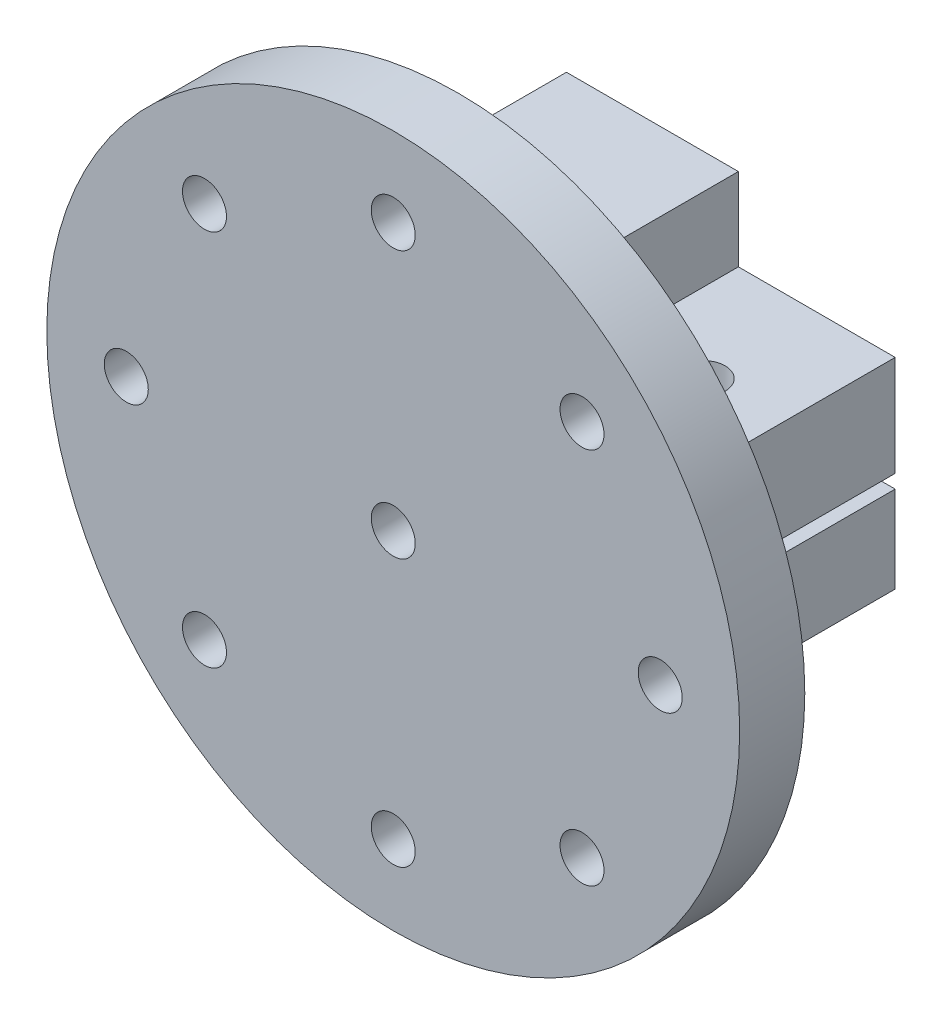
ISO-10303-21;
HEADER;
FILE_DESCRIPTION(('STEP AP214'),'2;1');
FILE_NAME('part.step','',(''),(''),'','','');
FILE_SCHEMA(('AUTOMOTIVE_DESIGN { 1 0 10303 214 1 1 1 1 }'));
ENDSEC;
DATA;
#1=APPLICATION_CONTEXT('core data for automotive mechanical design processes');
#2=APPLICATION_PROTOCOL_DEFINITION('international standard','automotive_design',2000,#1);
#3=PRODUCT_CONTEXT('',#1,'mechanical');
#4=PRODUCT('Part','Part','',(#3));
#5=PRODUCT_RELATED_PRODUCT_CATEGORY('part','',(#4));
#6=PRODUCT_DEFINITION_FORMATION('','',#4);
#7=PRODUCT_DEFINITION_CONTEXT('part definition',#1,'design');
#8=PRODUCT_DEFINITION('design','',#6,#7);
#9=PRODUCT_DEFINITION_SHAPE('','',#8);
#10=(LENGTH_UNIT() NAMED_UNIT(*) SI_UNIT(.MILLI.,.METRE.));
#11=(NAMED_UNIT(*) PLANE_ANGLE_UNIT() SI_UNIT($,.RADIAN.));
#12=(NAMED_UNIT(*) SI_UNIT($,.STERADIAN.) SOLID_ANGLE_UNIT());
#13=UNCERTAINTY_MEASURE_WITH_UNIT(LENGTH_MEASURE(1.E-05),#10,'distance_accuracy_value','');
#14=(GEOMETRIC_REPRESENTATION_CONTEXT(3) GLOBAL_UNCERTAINTY_ASSIGNED_CONTEXT((#13)) GLOBAL_UNIT_ASSIGNED_CONTEXT((#10,
#11,#12)) REPRESENTATION_CONTEXT('',''));
#15=CARTESIAN_POINT('',(0.,0.,0.));
#16=DIRECTION('',(0.,0.,1.));
#17=DIRECTION('',(1.,0.,0.));
#18=AXIS2_PLACEMENT_3D('',#15,#16,#17);
#19=CARTESIAN_POINT('',(20.8501032783887,0.,33.));
#20=DIRECTION('',(1.,0.,0.));
#21=DIRECTION('',(0.,0.,-1.));
#22=AXIS2_PLACEMENT_3D('',#19,#20,#21);
#23=PLANE('',#22);
#24=DIRECTION('',(0.,0.,-1.));
#25=VECTOR('',#24,1.);
#26=CARTESIAN_POINT('',(20.8501032783887,-0.961195415357511,33.));
#27=LINE('',#26,#25);
#28=CARTESIAN_POINT('',(20.8501032783887,-0.961195415357511,33.));
#29=VERTEX_POINT('',#28);
#30=CARTESIAN_POINT('',(20.8501032783887,-0.961195415357511,18.9436721702228));
#31=VERTEX_POINT('',#30);
#32=EDGE_CURVE('E236',#29,#31,#27,.T.);
#33=ORIENTED_EDGE('',*,*,#32,.T.);
#34=DIRECTION('',(0.,-1.,0.));
#35=VECTOR('',#34,1.);
#36=CARTESIAN_POINT('',(20.8501032783887,54.0388045846425,18.9436721702228));
#37=LINE('',#36,#35);
#38=CARTESIAN_POINT('',(20.8501032783887,-1.,18.9436721702228));
#39=VERTEX_POINT('',#38);
#40=EDGE_CURVE('E85',#31,#39,#37,.T.);
#41=ORIENTED_EDGE('',*,*,#40,.T.);
#42=DIRECTION('',(0.,0.,-1.));
#43=VECTOR('',#42,1.);
#44=CARTESIAN_POINT('',(20.8501032783887,-1.,285.));
#45=LINE('',#44,#43);
#46=CARTESIAN_POINT('',(20.8501032783887,-1.,33.0000000000001));
#47=VERTEX_POINT('',#46);
#48=EDGE_CURVE('E362',#47,#39,#45,.T.);
#49=ORIENTED_EDGE('',*,*,#48,.F.);
#50=DIRECTION('',(0.,-1.,0.));
#51=VECTOR('',#50,1.);
#52=CARTESIAN_POINT('',(20.8501032783887,0.,33.));
#53=LINE('',#52,#51);
#54=EDGE_CURVE('E426',#29,#47,#53,.T.);
#55=ORIENTED_EDGE('',*,*,#54,.F.);
#56=EDGE_LOOP('',(#33,#41,#49,#55));
#57=FACE_BOUND('',#56,.T.);
#58=ADVANCED_FACE('F69',(#57),#23,.F.);
#59=CARTESIAN_POINT('',(0.,0.,0.));
#60=DIRECTION('',(0.,0.,1.));
#61=DIRECTION('',(1.,0.,0.));
#62=AXIS2_PLACEMENT_3D('',#59,#60,#61);
#63=PLANE('',#62);
#64=DIRECTION('',(1.,0.,0.));
#65=VECTOR('',#64,1.);
#66=CARTESIAN_POINT('',(0.,1.,0.));
#67=LINE('',#66,#65);
#68=CARTESIAN_POINT('',(7.7,1.,0.));
#69=VERTEX_POINT('',#68);
#70=CARTESIAN_POINT('',(30.0469460781349,0.999999999999995,0.));
#71=VERTEX_POINT('',#70);
#72=EDGE_CURVE('E355',#69,#71,#67,.T.);
#73=ORIENTED_EDGE('',*,*,#72,.F.);
#74=DIRECTION('',(0.,-1.,0.));
#75=VECTOR('',#74,1.);
#76=CARTESIAN_POINT('',(7.7,0.,0.));
#77=LINE('',#76,#75);
#78=CARTESIAN_POINT('',(7.7,2.,0.));
#79=VERTEX_POINT('',#78);
#80=EDGE_CURVE('E461',#79,#69,#77,.T.);
#81=ORIENTED_EDGE('',*,*,#80,.F.);
#82=DIRECTION('',(1.,0.,0.));
#83=VECTOR('',#82,1.);
#84=CARTESIAN_POINT('',(0.,2.,0.));
#85=LINE('',#84,#83);
#86=CARTESIAN_POINT('',(5.65685424949238,2.,0.));
#87=VERTEX_POINT('',#86);
#88=EDGE_CURVE('E301',#87,#79,#85,.T.);
#89=ORIENTED_EDGE('',*,*,#88,.F.);
#90=CARTESIAN_POINT('',(0.,0.,0.));
#91=DIRECTION('',(0.,0.,-1.));
#92=DIRECTION('',(-1.,0.,0.));
#93=AXIS2_PLACEMENT_3D('',#90,#91,#92);
#94=CIRCLE('',#93,6.);
#95=CARTESIAN_POINT('',(5.65685424949238,-2.,0.));
#96=VERTEX_POINT('',#95);
#97=EDGE_CURVE('E279',#96,#87,#94,.T.);
#98=ORIENTED_EDGE('',*,*,#97,.F.);
#99=DIRECTION('',(-1.,0.,0.));
#100=VECTOR('',#99,1.);
#101=CARTESIAN_POINT('',(0.,-2.,0.));
#102=LINE('',#101,#100);
#103=CARTESIAN_POINT('',(7.7,-2.,0.));
#104=VERTEX_POINT('',#103);
#105=EDGE_CURVE('E283',#104,#96,#102,.T.);
#106=ORIENTED_EDGE('',*,*,#105,.F.);
#107=DIRECTION('',(0.,1.,0.));
#108=VECTOR('',#107,1.);
#109=CARTESIAN_POINT('',(7.7,0.,0.));
#110=LINE('',#109,#108);
#111=CARTESIAN_POINT('',(7.7,-1.,0.));
#112=VERTEX_POINT('',#111);
#113=EDGE_CURVE('E443',#104,#112,#110,.T.);
#114=ORIENTED_EDGE('',*,*,#113,.T.);
#115=DIRECTION('',(1.,0.,0.));
#116=VECTOR('',#115,1.);
#117=CARTESIAN_POINT('',(0.,-1.,0.));
#118=LINE('',#117,#116);
#119=CARTESIAN_POINT('',(20.8501032783887,-1.,0.));
#120=VERTEX_POINT('',#119);
#121=EDGE_CURVE('E359',#112,#120,#118,.T.);
#122=ORIENTED_EDGE('',*,*,#121,.T.);
#123=DIRECTION('',(0.,-1.,0.));
#124=VECTOR('',#123,1.);
#125=CARTESIAN_POINT('',(20.8501032783887,0.,0.));
#126=LINE('',#125,#124);
#127=CARTESIAN_POINT('',(20.8501032783887,-0.961195415357511,0.));
#128=VERTEX_POINT('',#127);
#129=EDGE_CURVE('E425',#128,#120,#126,.T.);
#130=ORIENTED_EDGE('',*,*,#129,.F.);
#131=DIRECTION('',(1.,0.,0.));
#132=VECTOR('',#131,1.);
#133=CARTESIAN_POINT('',(0.,-0.961195415357505,0.));
#134=LINE('',#133,#132);
#135=CARTESIAN_POINT('',(30.0469460781349,-0.961195415357513,0.));
#136=VERTEX_POINT('',#135);
#137=EDGE_CURVE('E235',#128,#136,#134,.T.);
#138=ORIENTED_EDGE('',*,*,#137,.T.);
#139=DIRECTION('',(0.,1.,0.));
#140=VECTOR('',#139,1.);
#141=CARTESIAN_POINT('',(30.0469460781349,0.,0.));
#142=LINE('',#141,#140);
#143=CARTESIAN_POINT('',(30.0469460781349,-13.4611954153575,0.));
#144=VERTEX_POINT('',#143);
#145=EDGE_CURVE('E428',#144,#136,#142,.T.);
#146=ORIENTED_EDGE('',*,*,#145,.F.);
#147=DIRECTION('',(1.,0.,0.));
#148=VECTOR('',#147,1.);
#149=CARTESIAN_POINT('',(7.5990817334569,-13.4611954153575,0.));
#150=LINE('',#149,#148);
#151=CARTESIAN_POINT('',(7.5990817334569,-13.4611954153575,0.));
#152=VERTEX_POINT('',#151);
#153=EDGE_CURVE('E413',#152,#144,#150,.T.);
#154=ORIENTED_EDGE('',*,*,#153,.F.);
#155=DIRECTION('',(0.,-1.,0.));
#156=VECTOR('',#155,1.);
#157=CARTESIAN_POINT('',(7.5990817334569,-6.64791006003498,0.));
#158=LINE('',#157,#156);
#159=CARTESIAN_POINT('',(7.59908173345689,-26.647910060035,0.));
#160=VERTEX_POINT('',#159);
#161=EDGE_CURVE('E254',#152,#160,#158,.T.);
#162=ORIENTED_EDGE('',*,*,#161,.T.);
#163=DIRECTION('',(1.,0.,0.));
#164=VECTOR('',#163,1.);
#165=CARTESIAN_POINT('',(-17.4009182665431,-26.647910060035,0.));
#166=LINE('',#165,#164);
#167=CARTESIAN_POINT('',(-17.4009182665431,-26.647910060035,0.));
#168=VERTEX_POINT('',#167);
#169=EDGE_CURVE('E266',#168,#160,#166,.T.);
#170=ORIENTED_EDGE('',*,*,#169,.F.);
#171=DIRECTION('',(0.,-1.,0.));
#172=VECTOR('',#171,1.);
#173=CARTESIAN_POINT('',(-17.4009182665431,-6.64791006003497,0.));
#174=LINE('',#173,#172);
#175=CARTESIAN_POINT('',(-17.4009182665431,27.414213562373,0.));
#176=VERTEX_POINT('',#175);
#177=EDGE_CURVE('E261',#176,#168,#174,.T.);
#178=ORIENTED_EDGE('',*,*,#177,.F.);
#179=DIRECTION('',(-1.,0.,0.));
#180=VECTOR('',#179,1.);
#181=CARTESIAN_POINT('',(0.,27.414213562373,0.));
#182=LINE('',#181,#180);
#183=CARTESIAN_POINT('',(7.41421356237295,27.414213562373,0.));
#184=VERTEX_POINT('',#183);
#185=EDGE_CURVE('E245',#184,#176,#182,.T.);
#186=ORIENTED_EDGE('',*,*,#185,.F.);
#187=DIRECTION('',(0.,1.,0.));
#188=VECTOR('',#187,1.);
#189=CARTESIAN_POINT('',(7.41421356237295,0.,0.));
#190=LINE('',#189,#188);
#191=CARTESIAN_POINT('',(7.41421356237295,15.5,0.));
#192=VERTEX_POINT('',#191);
#193=EDGE_CURVE('E248',#192,#184,#190,.T.);
#194=ORIENTED_EDGE('',*,*,#193,.F.);
#195=DIRECTION('',(-1.,0.,0.));
#196=VECTOR('',#195,1.);
#197=CARTESIAN_POINT('',(7.41421356237295,15.5,0.));
#198=LINE('',#197,#196);
#199=CARTESIAN_POINT('',(30.0469460781349,15.5,0.));
#200=VERTEX_POINT('',#199);
#201=EDGE_CURVE('E397',#200,#192,#198,.T.);
#202=ORIENTED_EDGE('',*,*,#201,.F.);
#203=DIRECTION('',(0.,-1.,0.));
#204=VECTOR('',#203,1.);
#205=CARTESIAN_POINT('',(30.0469460781349,0.,0.));
#206=LINE('',#205,#204);
#207=EDGE_CURVE('E408',#200,#71,#206,.T.);
#208=ORIENTED_EDGE('',*,*,#207,.T.);
#209=EDGE_LOOP('',(#73,#81,#89,#98,#106,#114,#122,#130,#138,#146,#154,#162,#170,#178,#186,#194,
#202,#208));
#210=FACE_BOUND('',#209,.T.);
#211=ADVANCED_FACE('F71',(#210),#63,.F.);
#212=CARTESIAN_POINT('',(0.,-1.,285.));
#213=DIRECTION('',(0.,1.,0.));
#214=DIRECTION('',(0.,0.,1.));
#215=AXIS2_PLACEMENT_3D('',#212,#213,#214);
#216=PLANE('',#215);
#217=CARTESIAN_POINT('',(18.8230139057959,-1.,16.5));
#218=DIRECTION('',(0.,1.,0.));
#219=DIRECTION('',(0.,0.,1.));
#220=AXIS2_PLACEMENT_3D('',#217,#218,#219);
#221=CIRCLE('',#220,3.175);
#222=CARTESIAN_POINT('',(20.8501032783887,-1.,14.0563278297772));
#223=VERTEX_POINT('',#222);
#224=EDGE_CURVE('E449',#223,#39,#221,.T.);
#225=ORIENTED_EDGE('',*,*,#224,.F.);
#226=EDGE_CURVE('E229',#223,#120,#45,.T.);
#227=ORIENTED_EDGE('',*,*,#226,.T.);
#228=ORIENTED_EDGE('',*,*,#121,.F.);
#229=DIRECTION('',(0.,0.,-1.));
#230=VECTOR('',#229,1.);
#231=CARTESIAN_POINT('',(7.7,-1.,33.));
#232=LINE('',#231,#230);
#233=CARTESIAN_POINT('',(7.7,-1.,33.));
#234=VERTEX_POINT('',#233);
#235=EDGE_CURVE('E448',#234,#112,#232,.T.);
#236=ORIENTED_EDGE('',*,*,#235,.F.);
#237=DIRECTION('',(-1.,0.,0.));
#238=VECTOR('',#237,1.);
#239=CARTESIAN_POINT('',(0.,-1.,33.));
#240=LINE('',#239,#238);
#241=EDGE_CURVE('E365',#47,#234,#240,.T.);
#242=ORIENTED_EDGE('',*,*,#241,.F.);
#243=ORIENTED_EDGE('',*,*,#48,.T.);
#244=EDGE_LOOP('',(#225,#227,#228,#236,#242,#243));
#245=FACE_BOUND('',#244,.T.);
#246=ADVANCED_FACE('F446',(#245),#216,.T.);
#247=CARTESIAN_POINT('',(0.,0.,33.));
#248=DIRECTION('',(0.,0.,1.));
#249=DIRECTION('',(1.,0.,0.));
#250=AXIS2_PLACEMENT_3D('',#247,#248,#249);
#251=PLANE('',#250);
#252=DIRECTION('',(1.,0.,0.));
#253=VECTOR('',#252,1.);
#254=CARTESIAN_POINT('',(7.5990817334569,-13.4611954153575,33.));
#255=LINE('',#254,#253);
#256=CARTESIAN_POINT('',(7.5990817334569,-13.4611954153575,33.));
#257=VERTEX_POINT('',#256);
#258=CARTESIAN_POINT('',(30.0469460781349,-13.4611954153575,33.));
#259=VERTEX_POINT('',#258);
#260=EDGE_CURVE('E410',#257,#259,#255,.T.);
#261=ORIENTED_EDGE('',*,*,#260,.T.);
#262=DIRECTION('',(0.,1.,0.));
#263=VECTOR('',#262,1.);
#264=CARTESIAN_POINT('',(30.0469460781349,0.,33.));
#265=LINE('',#264,#263);
#266=CARTESIAN_POINT('',(30.0469460781349,-0.961195415357513,33.));
#267=VERTEX_POINT('',#266);
#268=EDGE_CURVE('E237',#259,#267,#265,.T.);
#269=ORIENTED_EDGE('',*,*,#268,.T.);
#270=DIRECTION('',(1.,0.,0.));
#271=VECTOR('',#270,1.);
#272=CARTESIAN_POINT('',(0.,-0.961195415357505,33.));
#273=LINE('',#272,#271);
#274=EDGE_CURVE('E240',#29,#267,#273,.T.);
#275=ORIENTED_EDGE('',*,*,#274,.F.);
#276=ORIENTED_EDGE('',*,*,#54,.T.);
#277=ORIENTED_EDGE('',*,*,#241,.T.);
#278=DIRECTION('',(0.,1.,0.));
#279=VECTOR('',#278,1.);
#280=CARTESIAN_POINT('',(7.7,0.,33.));
#281=LINE('',#280,#279);
#282=CARTESIAN_POINT('',(7.7,-2.,33.));
#283=VERTEX_POINT('',#282);
#284=EDGE_CURVE('E467',#283,#234,#281,.T.);
#285=ORIENTED_EDGE('',*,*,#284,.F.);
#286=DIRECTION('',(-1.,0.,0.));
#287=VECTOR('',#286,1.);
#288=CARTESIAN_POINT('',(0.,-2.,33.));
#289=LINE('',#288,#287);
#290=CARTESIAN_POINT('',(5.65685424949238,-2.,33.));
#291=VERTEX_POINT('',#290);
#292=EDGE_CURVE('E286',#283,#291,#289,.T.);
#293=ORIENTED_EDGE('',*,*,#292,.T.);
#294=CARTESIAN_POINT('',(0.,0.,33.));
#295=DIRECTION('',(0.,0.,1.));
#296=DIRECTION('',(1.,0.,0.));
#297=AXIS2_PLACEMENT_3D('',#294,#295,#296);
#298=CIRCLE('',#297,6.);
#299=CARTESIAN_POINT('',(5.65685424949238,2.,33.));
#300=VERTEX_POINT('',#299);
#301=EDGE_CURVE('E371',#291,#300,#298,.T.);
#302=ORIENTED_EDGE('',*,*,#301,.T.);
#303=DIRECTION('',(1.,0.,0.));
#304=VECTOR('',#303,1.);
#305=CARTESIAN_POINT('',(0.,2.00000000000001,33.));
#306=LINE('',#305,#304);
#307=CARTESIAN_POINT('',(7.7,2.,33.));
#308=VERTEX_POINT('',#307);
#309=EDGE_CURVE('E289',#300,#308,#306,.T.);
#310=ORIENTED_EDGE('',*,*,#309,.T.);
#311=DIRECTION('',(0.,-1.,0.));
#312=VECTOR('',#311,1.);
#313=CARTESIAN_POINT('',(7.7,0.,33.));
#314=LINE('',#313,#312);
#315=CARTESIAN_POINT('',(7.7,1.,33.));
#316=VERTEX_POINT('',#315);
#317=EDGE_CURVE('E457',#308,#316,#314,.T.);
#318=ORIENTED_EDGE('',*,*,#317,.T.);
#319=DIRECTION('',(-1.,0.,0.));
#320=VECTOR('',#319,1.);
#321=CARTESIAN_POINT('',(0.,1.,33.));
#322=LINE('',#321,#320);
#323=CARTESIAN_POINT('',(30.0469460781349,0.999999999999995,33.));
#324=VERTEX_POINT('',#323);
#325=EDGE_CURVE('E368',#324,#316,#322,.T.);
#326=ORIENTED_EDGE('',*,*,#325,.F.);
#327=DIRECTION('',(0.,-1.,0.));
#328=VECTOR('',#327,1.);
#329=CARTESIAN_POINT('',(30.0469460781349,0.,33.));
#330=LINE('',#329,#328);
#331=CARTESIAN_POINT('',(30.0469460781349,15.5,33.));
#332=VERTEX_POINT('',#331);
#333=EDGE_CURVE('E93',#332,#324,#330,.T.);
#334=ORIENTED_EDGE('',*,*,#333,.F.);
#335=DIRECTION('',(-1.,0.,0.));
#336=VECTOR('',#335,1.);
#337=CARTESIAN_POINT('',(7.41421356237295,15.5,33.));
#338=LINE('',#337,#336);
#339=CARTESIAN_POINT('',(7.41421356237295,15.5,33.));
#340=VERTEX_POINT('',#339);
#341=EDGE_CURVE('E394',#332,#340,#338,.T.);
#342=ORIENTED_EDGE('',*,*,#341,.T.);
#343=DIRECTION('',(0.,-1.,0.));
#344=VECTOR('',#343,1.);
#345=CARTESIAN_POINT('',(7.41421356237295,0.,33.));
#346=LINE('',#345,#344);
#347=CARTESIAN_POINT('',(7.41421356237295,27.414213562373,33.));
#348=VERTEX_POINT('',#347);
#349=EDGE_CURVE('E12',#348,#340,#346,.T.);
#350=ORIENTED_EDGE('',*,*,#349,.F.);
#351=DIRECTION('',(1.,0.,0.));
#352=VECTOR('',#351,1.);
#353=CARTESIAN_POINT('',(0.,27.414213562373,33.));
#354=LINE('',#353,#352);
#355=CARTESIAN_POINT('',(-17.4009182665431,27.414213562373,33.));
#356=VERTEX_POINT('',#355);
#357=EDGE_CURVE('E78',#356,#348,#354,.T.);
#358=ORIENTED_EDGE('',*,*,#357,.F.);
#359=DIRECTION('',(0.,-1.,0.));
#360=VECTOR('',#359,1.);
#361=CARTESIAN_POINT('',(-17.4009182665431,-6.64791006003497,33.));
#362=LINE('',#361,#360);
#363=CARTESIAN_POINT('',(-17.4009182665431,-26.647910060035,33.));
#364=VERTEX_POINT('',#363);
#365=EDGE_CURVE('E260',#356,#364,#362,.T.);
#366=ORIENTED_EDGE('',*,*,#365,.T.);
#367=DIRECTION('',(1.,0.,0.));
#368=VECTOR('',#367,1.);
#369=CARTESIAN_POINT('',(-17.4009182665431,-26.647910060035,33.));
#370=LINE('',#369,#368);
#371=CARTESIAN_POINT('',(7.59908173345689,-26.647910060035,33.));
#372=VERTEX_POINT('',#371);
#373=EDGE_CURVE('E257',#364,#372,#370,.T.);
#374=ORIENTED_EDGE('',*,*,#373,.T.);
#375=DIRECTION('',(0.,1.,0.));
#376=VECTOR('',#375,1.);
#377=CARTESIAN_POINT('',(7.5990817334569,0.,33.));
#378=LINE('',#377,#376);
#379=EDGE_CURVE('E374',#372,#257,#378,.T.);
#380=ORIENTED_EDGE('',*,*,#379,.T.);
#381=EDGE_LOOP('',(#261,#269,#275,#276,#277,#285,#293,#302,#310,#318,#326,#334,#342,#350,#358,
#366,#374,#380));
#382=FACE_BOUND('',#381,.T.);
#383=CARTESIAN_POINT('',(0.,0.,33.));
#384=DIRECTION('',(0.,0.,1.));
#385=DIRECTION('',(1.,0.,0.));
#386=AXIS2_PLACEMENT_3D('',#383,#384,#385);
#387=CIRCLE('',#386,50.);
#388=CARTESIAN_POINT('',(50.,0.,33.));
#389=VERTEX_POINT('',#388);
#390=EDGE_CURVE('E351',#389,#389,#387,.T.);
#391=ORIENTED_EDGE('',*,*,#390,.F.);
#392=EDGE_LOOP('',(#391));
#393=FACE_BOUND('',#392,.T.);
#394=CARTESIAN_POINT('',(27.2450640302655,27.2450640302662,33.));
#395=DIRECTION('',(0.,0.,1.));
#396=DIRECTION('',(1.,0.,0.));
#397=AXIS2_PLACEMENT_3D('',#394,#395,#396);
#398=CIRCLE('',#397,3.17500000000076);
#399=CARTESIAN_POINT('',(30.4200640302663,27.2450640302662,33.));
#400=VERTEX_POINT('',#399);
#401=EDGE_CURVE('E316',#400,#400,#398,.T.);
#402=ORIENTED_EDGE('',*,*,#401,.T.);
#403=EDGE_LOOP('',(#402));
#404=FACE_BOUND('',#403,.T.);
#405=CARTESIAN_POINT('',(-1.61078463866241E-12,38.5303390593249,33.));
#406=DIRECTION('',(0.,0.,1.));
#407=DIRECTION('',(1.,0.,0.));
#408=AXIS2_PLACEMENT_3D('',#405,#406,#407);
#409=CIRCLE('',#408,3.1750000000009);
#410=CARTESIAN_POINT('',(3.17499999999929,38.5303390593249,33.));
#411=VERTEX_POINT('',#410);
#412=EDGE_CURVE('E303',#411,#411,#409,.T.);
#413=ORIENTED_EDGE('',*,*,#412,.T.);
#414=EDGE_LOOP('',(#413));
#415=FACE_BOUND('',#414,.T.);
#416=CARTESIAN_POINT('',(38.5303390593264,0.,33.));
#417=DIRECTION('',(0.,0.,1.));
#418=DIRECTION('',(1.,0.,0.));
#419=AXIS2_PLACEMENT_3D('',#416,#417,#418);
#420=CIRCLE('',#419,3.17500000000001);
#421=CARTESIAN_POINT('',(41.7053390593264,0.,33.));
#422=VERTEX_POINT('',#421);
#423=EDGE_CURVE('E308',#422,#422,#420,.T.);
#424=ORIENTED_EDGE('',*,*,#423,.T.);
#425=EDGE_LOOP('',(#424));
#426=FACE_BOUND('',#425,.T.);
#427=CARTESIAN_POINT('',(27.2450640302678,-27.2450640302671,33.));
#428=DIRECTION('',(0.,0.,1.));
#429=DIRECTION('',(1.,0.,0.));
#430=AXIS2_PLACEMENT_3D('',#427,#428,#429);
#431=CIRCLE('',#430,3.17499999999871);
#432=CARTESIAN_POINT('',(30.4200640302665,-27.2450640302671,33.));
#433=VERTEX_POINT('',#432);
#434=EDGE_CURVE('E304',#433,#433,#431,.T.);
#435=ORIENTED_EDGE('',*,*,#434,.T.);
#436=EDGE_LOOP('',(#435));
#437=FACE_BOUND('',#436,.T.);
#438=CARTESIAN_POINT('',(1.60606603302251E-12,-38.5303390593281,33.));
#439=DIRECTION('',(0.,0.,1.));
#440=DIRECTION('',(1.,0.,0.));
#441=AXIS2_PLACEMENT_3D('',#438,#439,#440);
#442=CIRCLE('',#441,3.17499999999792);
#443=CARTESIAN_POINT('',(3.17499999999953,-38.5303390593281,33.));
#444=VERTEX_POINT('',#443);
#445=EDGE_CURVE('E307',#444,#444,#442,.T.);
#446=ORIENTED_EDGE('',*,*,#445,.T.);
#447=EDGE_LOOP('',(#446));
#448=FACE_BOUND('',#447,.T.);
#449=CARTESIAN_POINT('',(-27.2450640302655,-27.2450640302694,33.));
#450=DIRECTION('',(0.,0.,1.));
#451=DIRECTION('',(1.,0.,0.));
#452=AXIS2_PLACEMENT_3D('',#449,#450,#451);
#453=CIRCLE('',#452,3.17499999999801);
#454=CARTESIAN_POINT('',(-24.0700640302675,-27.2450640302694,33.));
#455=VERTEX_POINT('',#454);
#456=EDGE_CURVE('E320',#455,#455,#453,.T.);
#457=ORIENTED_EDGE('',*,*,#456,.T.);
#458=EDGE_LOOP('',(#457));
#459=FACE_BOUND('',#458,.T.);
#460=CARTESIAN_POINT('',(-38.5303390593265,-3.21174324068629E-12,33.));
#461=DIRECTION('',(0.,0.,1.));
#462=DIRECTION('',(1.,0.,0.));
#463=AXIS2_PLACEMENT_3D('',#460,#461,#462);
#464=CIRCLE('',#463,3.17499999999894);
#465=CARTESIAN_POINT('',(-35.3553390593275,-3.21174324068629E-12,33.));
#466=VERTEX_POINT('',#465);
#467=EDGE_CURVE('E317',#466,#466,#464,.T.);
#468=ORIENTED_EDGE('',*,*,#467,.T.);
#469=EDGE_LOOP('',(#468));
#470=FACE_BOUND('',#469,.T.);
#471=CARTESIAN_POINT('',(-27.2450640302678,27.2450640302639,33.));
#472=DIRECTION('',(0.,0.,1.));
#473=DIRECTION('',(1.,0.,0.));
#474=AXIS2_PLACEMENT_3D('',#471,#472,#473);
#475=CIRCLE('',#474,3.17500000000014);
#476=CARTESIAN_POINT('',(-24.0700640302677,27.2450640302639,33.));
#477=VERTEX_POINT('',#476);
#478=EDGE_CURVE('E313',#477,#477,#475,.T.);
#479=ORIENTED_EDGE('',*,*,#478,.T.);
#480=EDGE_LOOP('',(#479));
#481=FACE_BOUND('',#480,.T.);
#482=ADVANCED_FACE('F392',(#382,#393,#404,#415,#426,#437,#448,#459,#470,#481),#251,.F.);
#483=CARTESIAN_POINT('',(7.41421356237295,0.,34.));
#484=DIRECTION('',(-1.,0.,0.));
#485=DIRECTION('',(0.,0.,1.));
#486=AXIS2_PLACEMENT_3D('',#483,#484,#485);
#487=PLANE('',#486);
#488=ORIENTED_EDGE('',*,*,#349,.T.);
#489=DIRECTION('',(0.,0.,-1.));
#490=VECTOR('',#489,1.);
#491=CARTESIAN_POINT('',(7.41421356237295,15.5,33.));
#492=LINE('',#491,#490);
#493=EDGE_CURVE('E399',#340,#192,#492,.T.);
#494=ORIENTED_EDGE('',*,*,#493,.T.);
#495=ORIENTED_EDGE('',*,*,#193,.T.);
#496=DIRECTION('',(0.,0.,-1.));
#497=VECTOR('',#496,1.);
#498=CARTESIAN_POINT('',(7.41421356237295,27.414213562373,34.));
#499=LINE('',#498,#497);
#500=EDGE_CURVE('E251',#348,#184,#499,.T.);
#501=ORIENTED_EDGE('',*,*,#500,.F.);
#502=EDGE_LOOP('',(#488,#494,#495,#501));
#503=FACE_BOUND('',#502,.T.);
#504=ADVANCED_FACE('F387',(#503),#487,.F.);
#505=CARTESIAN_POINT('',(0.,0.,34.));
#506=DIRECTION('',(0.,0.,-1.));
#507=DIRECTION('',(-1.,0.,0.));
#508=AXIS2_PLACEMENT_3D('',#505,#506,#507);
#509=CYLINDRICAL_SURFACE('',#508,6.);
#510=DIRECTION('',(0.,0.,-1.));
#511=VECTOR('',#510,1.);
#512=CARTESIAN_POINT('',(5.65685424949238,-2.,46.));
#513=LINE('',#512,#511);
#514=CARTESIAN_POINT('',(5.65685424949238,-2.,31.));
#515=VERTEX_POINT('',#514);
#516=EDGE_CURVE('E297',#515,#291,#513,.F.);
#517=ORIENTED_EDGE('',*,*,#516,.F.);
#518=CARTESIAN_POINT('',(0.,0.,31.));
#519=DIRECTION('',(0.,0.,-1.));
#520=DIRECTION('',(-1.,0.,0.));
#521=AXIS2_PLACEMENT_3D('',#518,#519,#520);
#522=CIRCLE('',#521,6.);
#523=CARTESIAN_POINT('',(5.65685424949238,2.,31.));
#524=VERTEX_POINT('',#523);
#525=EDGE_CURVE('E280',#524,#515,#522,.T.);
#526=ORIENTED_EDGE('',*,*,#525,.F.);
#527=DIRECTION('',(0.,0.,-1.));
#528=VECTOR('',#527,1.);
#529=CARTESIAN_POINT('',(5.65685424949238,2.,33.));
#530=LINE('',#529,#528);
#531=EDGE_CURVE('E294',#300,#524,#530,.T.);
#532=ORIENTED_EDGE('',*,*,#531,.F.);
#533=ORIENTED_EDGE('',*,*,#301,.F.);
#534=EDGE_LOOP('',(#517,#526,#532,#533));
#535=FACE_BOUND('',#534,.T.);
#536=ADVANCED_FACE('F524',(#535),#509,.T.);
#537=CARTESIAN_POINT('',(0.,2.,33.));
#538=DIRECTION('',(0.,1.,0.));
#539=DIRECTION('',(-1.,0.,0.));
#540=AXIS2_PLACEMENT_3D('',#537,#538,#539);
#541=PLANE('',#540);
#542=ORIENTED_EDGE('',*,*,#531,.T.);
#543=EDGE_CURVE('E291',#524,#87,#530,.T.);
#544=ORIENTED_EDGE('',*,*,#543,.T.);
#545=ORIENTED_EDGE('',*,*,#88,.T.);
#546=DIRECTION('',(0.,0.,-1.));
#547=VECTOR('',#546,1.);
#548=CARTESIAN_POINT('',(7.7,2.,33.));
#549=LINE('',#548,#547);
#550=EDGE_CURVE('E415',#308,#79,#549,.T.);
#551=ORIENTED_EDGE('',*,*,#550,.F.);
#552=ORIENTED_EDGE('',*,*,#309,.F.);
#553=EDGE_LOOP('',(#542,#544,#545,#551,#552));
#554=FACE_BOUND('',#553,.T.);
#555=ADVANCED_FACE('F527',(#554),#541,.F.);
#556=CARTESIAN_POINT('',(0.,-2.,33.));
#557=DIRECTION('',(0.,-1.,0.));
#558=DIRECTION('',(1.,0.,0.));
#559=AXIS2_PLACEMENT_3D('',#556,#557,#558);
#560=PLANE('',#559);
#561=ORIENTED_EDGE('',*,*,#105,.T.);
#562=EDGE_CURVE('E298',#96,#515,#513,.F.);
#563=ORIENTED_EDGE('',*,*,#562,.T.);
#564=ORIENTED_EDGE('',*,*,#516,.T.);
#565=ORIENTED_EDGE('',*,*,#292,.F.);
#566=DIRECTION('',(0.,0.,-1.));
#567=VECTOR('',#566,1.);
#568=CARTESIAN_POINT('',(7.7,-2.,33.));
#569=LINE('',#568,#567);
#570=EDGE_CURVE('E405',#283,#104,#569,.T.);
#571=ORIENTED_EDGE('',*,*,#570,.T.);
#572=EDGE_LOOP('',(#561,#563,#564,#565,#571));
#573=FACE_BOUND('',#572,.T.);
#574=ADVANCED_FACE('F473',(#573),#560,.F.);
#575=CARTESIAN_POINT('',(0.,1.,285.));
#576=DIRECTION('',(0.,1.,0.));
#577=DIRECTION('',(0.,0.,1.));
#578=AXIS2_PLACEMENT_3D('',#575,#576,#577);
#579=PLANE('',#578);
#580=CARTESIAN_POINT('',(18.8230139057959,1.,16.5));
#581=DIRECTION('',(0.,1.,0.));
#582=DIRECTION('',(0.,0.,1.));
#583=AXIS2_PLACEMENT_3D('',#580,#581,#582);
#584=CIRCLE('',#583,3.175);
#585=CARTESIAN_POINT('',(18.8230139057959,1.,19.675));
#586=VERTEX_POINT('',#585);
#587=EDGE_CURVE('E451',#586,#586,#584,.T.);
#588=ORIENTED_EDGE('',*,*,#587,.T.);
#589=EDGE_LOOP('',(#588));
#590=FACE_BOUND('',#589,.T.);
#591=ORIENTED_EDGE('',*,*,#325,.T.);
#592=DIRECTION('',(0.,0.,-1.));
#593=VECTOR('',#592,1.);
#594=CARTESIAN_POINT('',(7.7,1.,33.));
#595=LINE('',#594,#593);
#596=EDGE_CURVE('E460',#316,#69,#595,.T.);
#597=ORIENTED_EDGE('',*,*,#596,.T.);
#598=ORIENTED_EDGE('',*,*,#72,.T.);
#599=DIRECTION('',(0.,0.,-1.));
#600=VECTOR('',#599,1.);
#601=CARTESIAN_POINT('',(30.0469460781349,0.999999999999995,33.));
#602=LINE('',#601,#600);
#603=EDGE_CURVE('E421',#324,#71,#602,.T.);
#604=ORIENTED_EDGE('',*,*,#603,.F.);
#605=EDGE_LOOP('',(#591,#597,#598,#604));
#606=FACE_BOUND('',#605,.T.);
#607=ADVANCED_FACE('F531',(#590,#606),#579,.F.);
#608=CARTESIAN_POINT('',(0.,0.,42.398));
#609=DIRECTION('',(0.,0.,-1.));
#610=DIRECTION('',(-1.,0.,0.));
#611=AXIS2_PLACEMENT_3D('',#608,#609,#610);
#612=CYLINDRICAL_SURFACE('',#611,50.);
#613=CARTESIAN_POINT('',(0.,0.,42.398));
#614=DIRECTION('',(0.,0.,1.));
#615=DIRECTION('',(1.,0.,0.));
#616=AXIS2_PLACEMENT_3D('',#613,#614,#615);
#617=CIRCLE('',#616,50.);
#618=CARTESIAN_POINT('',(50.,0.,42.398));
#619=VERTEX_POINT('',#618);
#620=EDGE_CURVE('E352',#619,#619,#617,.T.);
#621=ORIENTED_EDGE('',*,*,#620,.F.);
#622=EDGE_LOOP('',(#621));
#623=FACE_BOUND('',#622,.T.);
#624=ORIENTED_EDGE('',*,*,#390,.T.);
#625=EDGE_LOOP('',(#624));
#626=FACE_BOUND('',#625,.T.);
#627=ADVANCED_FACE('F569',(#623,#626),#612,.T.);
#628=CARTESIAN_POINT('',(0.,0.,42.398));
#629=DIRECTION('',(0.,0.,1.));
#630=DIRECTION('',(1.,0.,0.));
#631=AXIS2_PLACEMENT_3D('',#628,#629,#630);
#632=PLANE('',#631);
#633=CARTESIAN_POINT('',(0.,0.,42.398));
#634=DIRECTION('',(0.,0.,1.));
#635=DIRECTION('',(1.,0.,0.));
#636=AXIS2_PLACEMENT_3D('',#633,#634,#635);
#637=CIRCLE('',#636,3.175);
#638=CARTESIAN_POINT('',(3.175,0.,42.398));
#639=VERTEX_POINT('',#638);
#640=EDGE_CURVE('E273',#639,#639,#637,.T.);
#641=ORIENTED_EDGE('',*,*,#640,.F.);
#642=EDGE_LOOP('',(#641));
#643=FACE_BOUND('',#642,.T.);
#644=CARTESIAN_POINT('',(-27.2450640302678,27.2450640302639,42.398));
#645=DIRECTION('',(0.,0.,1.));
#646=DIRECTION('',(1.,0.,0.));
#647=AXIS2_PLACEMENT_3D('',#644,#645,#646);
#648=CIRCLE('',#647,3.17500000000014);
#649=CARTESIAN_POINT('',(-24.0700640302677,27.2450640302639,42.398));
#650=VERTEX_POINT('',#649);
#651=EDGE_CURVE('E348',#650,#650,#648,.F.);
#652=ORIENTED_EDGE('',*,*,#651,.T.);
#653=EDGE_LOOP('',(#652));
#654=FACE_BOUND('',#653,.T.);
#655=CARTESIAN_POINT('',(-38.5303390593265,-3.21174324068629E-12,42.398));
#656=DIRECTION('',(0.,0.,1.));
#657=DIRECTION('',(1.,0.,0.));
#658=AXIS2_PLACEMENT_3D('',#655,#656,#657);
#659=CIRCLE('',#658,3.17499999999894);
#660=CARTESIAN_POINT('',(-35.3553390593275,-3.21174324068629E-12,42.398));
#661=VERTEX_POINT('',#660);
#662=EDGE_CURVE('E345',#661,#661,#659,.F.);
#663=ORIENTED_EDGE('',*,*,#662,.T.);
#664=EDGE_LOOP('',(#663));
#665=FACE_BOUND('',#664,.T.);
#666=CARTESIAN_POINT('',(-27.2450640302655,-27.2450640302694,42.398));
#667=DIRECTION('',(0.,0.,1.));
#668=DIRECTION('',(1.,0.,0.));
#669=AXIS2_PLACEMENT_3D('',#666,#667,#668);
#670=CIRCLE('',#669,3.17499999999801);
#671=CARTESIAN_POINT('',(-24.0700640302675,-27.2450640302694,42.398));
#672=VERTEX_POINT('',#671);
#673=EDGE_CURVE('E342',#672,#672,#670,.F.);
#674=ORIENTED_EDGE('',*,*,#673,.T.);
#675=EDGE_LOOP('',(#674));
#676=FACE_BOUND('',#675,.T.);
#677=CARTESIAN_POINT('',(1.60606603302251E-12,-38.5303390593281,42.398));
#678=DIRECTION('',(0.,0.,1.));
#679=DIRECTION('',(1.,0.,0.));
#680=AXIS2_PLACEMENT_3D('',#677,#678,#679);
#681=CIRCLE('',#680,3.17499999999792);
#682=CARTESIAN_POINT('',(3.17499999999953,-38.5303390593281,42.398));
#683=VERTEX_POINT('',#682);
#684=EDGE_CURVE('E339',#683,#683,#681,.F.);
#685=ORIENTED_EDGE('',*,*,#684,.T.);
#686=EDGE_LOOP('',(#685));
#687=FACE_BOUND('',#686,.T.);
#688=CARTESIAN_POINT('',(27.2450640302678,-27.2450640302671,42.398));
#689=DIRECTION('',(0.,0.,1.));
#690=DIRECTION('',(1.,0.,0.));
#691=AXIS2_PLACEMENT_3D('',#688,#689,#690);
#692=CIRCLE('',#691,3.17499999999871);
#693=CARTESIAN_POINT('',(30.4200640302665,-27.2450640302671,42.398));
#694=VERTEX_POINT('',#693);
#695=EDGE_CURVE('E336',#694,#694,#692,.F.);
#696=ORIENTED_EDGE('',*,*,#695,.T.);
#697=EDGE_LOOP('',(#696));
#698=FACE_BOUND('',#697,.T.);
#699=CARTESIAN_POINT('',(38.5303390593264,0.,42.398));
#700=DIRECTION('',(0.,0.,1.));
#701=DIRECTION('',(1.,0.,0.));
#702=AXIS2_PLACEMENT_3D('',#699,#700,#701);
#703=CIRCLE('',#702,3.17500000000001);
#704=CARTESIAN_POINT('',(41.7053390593264,0.,42.398));
#705=VERTEX_POINT('',#704);
#706=EDGE_CURVE('E333',#705,#705,#703,.F.);
#707=ORIENTED_EDGE('',*,*,#706,.T.);
#708=EDGE_LOOP('',(#707));
#709=FACE_BOUND('',#708,.T.);
#710=CARTESIAN_POINT('',(-1.61078463866241E-12,38.5303390593249,42.398));
#711=DIRECTION('',(0.,0.,1.));
#712=DIRECTION('',(1.,0.,0.));
#713=AXIS2_PLACEMENT_3D('',#710,#711,#712);
#714=CIRCLE('',#713,3.1750000000009);
#715=CARTESIAN_POINT('',(3.17499999999929,38.5303390593249,42.398));
#716=VERTEX_POINT('',#715);
#717=EDGE_CURVE('E330',#716,#716,#714,.F.);
#718=ORIENTED_EDGE('',*,*,#717,.T.);
#719=EDGE_LOOP('',(#718));
#720=FACE_BOUND('',#719,.T.);
#721=CARTESIAN_POINT('',(27.2450640302655,27.2450640302662,42.398));
#722=DIRECTION('',(0.,0.,1.));
#723=DIRECTION('',(1.,0.,0.));
#724=AXIS2_PLACEMENT_3D('',#721,#722,#723);
#725=CIRCLE('',#724,3.17500000000076);
#726=CARTESIAN_POINT('',(30.4200640302663,27.2450640302662,42.398));
#727=VERTEX_POINT('',#726);
#728=EDGE_CURVE('E327',#727,#727,#725,.F.);
#729=ORIENTED_EDGE('',*,*,#728,.T.);
#730=EDGE_LOOP('',(#729));
#731=FACE_BOUND('',#730,.T.);
#732=ORIENTED_EDGE('',*,*,#620,.T.);
#733=EDGE_LOOP('',(#732));
#734=FACE_BOUND('',#733,.T.);
#735=ADVANCED_FACE('F565',(#643,#654,#665,#676,#687,#698,#709,#720,#731,#734),#632,.T.);
#736=CARTESIAN_POINT('',(27.2450640302655,27.2450640302662,96.));
#737=DIRECTION('',(0.,0.,-1.));
#738=DIRECTION('',(-1.,0.,0.));
#739=AXIS2_PLACEMENT_3D('',#736,#737,#738);
#740=CYLINDRICAL_SURFACE('',#739,3.17500000000076);
#741=ORIENTED_EDGE('',*,*,#728,.F.);
#742=EDGE_LOOP('',(#741));
#743=FACE_BOUND('',#742,.T.);
#744=ORIENTED_EDGE('',*,*,#401,.F.);
#745=EDGE_LOOP('',(#744));
#746=FACE_BOUND('',#745,.T.);
#747=ADVANCED_FACE('F547',(#743,#746),#740,.F.);
#748=CARTESIAN_POINT('',(-1.61078463866241E-12,38.5303390593249,96.));
#749=DIRECTION('',(0.,0.,-1.));
#750=DIRECTION('',(-1.,0.,0.));
#751=AXIS2_PLACEMENT_3D('',#748,#749,#750);
#752=CYLINDRICAL_SURFACE('',#751,3.1750000000009);
#753=ORIENTED_EDGE('',*,*,#717,.F.);
#754=EDGE_LOOP('',(#753));
#755=FACE_BOUND('',#754,.T.);
#756=ORIENTED_EDGE('',*,*,#412,.F.);
#757=EDGE_LOOP('',(#756));
#758=FACE_BOUND('',#757,.T.);
#759=ADVANCED_FACE('F543',(#755,#758),#752,.F.);
#760=CARTESIAN_POINT('',(38.5303390593264,0.,96.));
#761=DIRECTION('',(0.,0.,-1.));
#762=DIRECTION('',(-1.,0.,0.));
#763=AXIS2_PLACEMENT_3D('',#760,#761,#762);
#764=CYLINDRICAL_SURFACE('',#763,3.17500000000001);
#765=ORIENTED_EDGE('',*,*,#706,.F.);
#766=EDGE_LOOP('',(#765));
#767=FACE_BOUND('',#766,.T.);
#768=ORIENTED_EDGE('',*,*,#423,.F.);
#769=EDGE_LOOP('',(#768));
#770=FACE_BOUND('',#769,.T.);
#771=ADVANCED_FACE('F539',(#767,#770),#764,.F.);
#772=CARTESIAN_POINT('',(27.2450640302678,-27.2450640302671,96.));
#773=DIRECTION('',(0.,0.,-1.));
#774=DIRECTION('',(-1.,0.,0.));
#775=AXIS2_PLACEMENT_3D('',#772,#773,#774);
#776=CYLINDRICAL_SURFACE('',#775,3.17499999999871);
#777=ORIENTED_EDGE('',*,*,#695,.F.);
#778=EDGE_LOOP('',(#777));
#779=FACE_BOUND('',#778,.T.);
#780=ORIENTED_EDGE('',*,*,#434,.F.);
#781=EDGE_LOOP('',(#780));
#782=FACE_BOUND('',#781,.T.);
#783=ADVANCED_FACE('F535',(#779,#782),#776,.F.);
#784=CARTESIAN_POINT('',(1.60606603302251E-12,-38.5303390593281,96.));
#785=DIRECTION('',(0.,0.,-1.));
#786=DIRECTION('',(-1.,0.,0.));
#787=AXIS2_PLACEMENT_3D('',#784,#785,#786);
#788=CYLINDRICAL_SURFACE('',#787,3.17499999999792);
#789=ORIENTED_EDGE('',*,*,#684,.F.);
#790=EDGE_LOOP('',(#789));
#791=FACE_BOUND('',#790,.T.);
#792=ORIENTED_EDGE('',*,*,#445,.F.);
#793=EDGE_LOOP('',(#792));
#794=FACE_BOUND('',#793,.T.);
#795=ADVANCED_FACE('F538',(#791,#794),#788,.F.);
#796=CARTESIAN_POINT('',(-27.2450640302655,-27.2450640302694,96.));
#797=DIRECTION('',(0.,0.,-1.));
#798=DIRECTION('',(-1.,0.,0.));
#799=AXIS2_PLACEMENT_3D('',#796,#797,#798);
#800=CYLINDRICAL_SURFACE('',#799,3.17499999999801);
#801=ORIENTED_EDGE('',*,*,#673,.F.);
#802=EDGE_LOOP('',(#801));
#803=FACE_BOUND('',#802,.T.);
#804=ORIENTED_EDGE('',*,*,#456,.F.);
#805=EDGE_LOOP('',(#804));
#806=FACE_BOUND('',#805,.T.);
#807=ADVANCED_FACE('F555',(#803,#806),#800,.F.);
#808=CARTESIAN_POINT('',(-38.5303390593265,-3.21174324068629E-12,96.));
#809=DIRECTION('',(0.,0.,-1.));
#810=DIRECTION('',(-1.,0.,0.));
#811=AXIS2_PLACEMENT_3D('',#808,#809,#810);
#812=CYLINDRICAL_SURFACE('',#811,3.17499999999894);
#813=ORIENTED_EDGE('',*,*,#662,.F.);
#814=EDGE_LOOP('',(#813));
#815=FACE_BOUND('',#814,.T.);
#816=ORIENTED_EDGE('',*,*,#467,.F.);
#817=EDGE_LOOP('',(#816));
#818=FACE_BOUND('',#817,.T.);
#819=ADVANCED_FACE('F551',(#815,#818),#812,.F.);
#820=CARTESIAN_POINT('',(-27.2450640302678,27.2450640302639,96.));
#821=DIRECTION('',(0.,0.,-1.));
#822=DIRECTION('',(-1.,0.,0.));
#823=AXIS2_PLACEMENT_3D('',#820,#821,#822);
#824=CYLINDRICAL_SURFACE('',#823,3.17500000000014);
#825=ORIENTED_EDGE('',*,*,#651,.F.);
#826=EDGE_LOOP('',(#825));
#827=FACE_BOUND('',#826,.T.);
#828=ORIENTED_EDGE('',*,*,#478,.F.);
#829=EDGE_LOOP('',(#828));
#830=FACE_BOUND('',#829,.T.);
#831=ADVANCED_FACE('F519',(#827,#830),#824,.F.);
#832=CARTESIAN_POINT('',(0.,0.,31.));
#833=DIRECTION('',(0.,0.,-1.));
#834=DIRECTION('',(-1.,0.,0.));
#835=AXIS2_PLACEMENT_3D('',#832,#833,#834);
#836=CYLINDRICAL_SURFACE('',#835,6.);
#837=EDGE_CURVE('E284',#515,#524,#522,.T.);
#838=ORIENTED_EDGE('',*,*,#837,.F.);
#839=ORIENTED_EDGE('',*,*,#562,.F.);
#840=ORIENTED_EDGE('',*,*,#97,.T.);
#841=ORIENTED_EDGE('',*,*,#543,.F.);
#842=EDGE_LOOP('',(#838,#839,#840,#841));
#843=FACE_BOUND('',#842,.T.);
#844=ADVANCED_FACE('F515',(#843),#836,.F.);
#845=CARTESIAN_POINT('',(0.,0.,31.));
#846=DIRECTION('',(0.,0.,-1.));
#847=DIRECTION('',(-1.,0.,0.));
#848=AXIS2_PLACEMENT_3D('',#845,#846,#847);
#849=PLANE('',#848);
#850=CARTESIAN_POINT('',(0.,0.,31.));
#851=DIRECTION('',(0.,0.,-1.));
#852=DIRECTION('',(-1.,0.,0.));
#853=AXIS2_PLACEMENT_3D('',#850,#851,#852);
#854=CIRCLE('',#853,3.175);
#855=CARTESIAN_POINT('',(-3.175,0.,31.));
#856=VERTEX_POINT('',#855);
#857=EDGE_CURVE('E276',#856,#856,#854,.T.);
#858=ORIENTED_EDGE('',*,*,#857,.F.);
#859=EDGE_LOOP('',(#858));
#860=FACE_BOUND('',#859,.T.);
#861=ORIENTED_EDGE('',*,*,#525,.T.);
#862=ORIENTED_EDGE('',*,*,#837,.T.);
#863=EDGE_LOOP('',(#861,#862));
#864=FACE_BOUND('',#863,.T.);
#865=ADVANCED_FACE('F512',(#860,#864),#849,.T.);
#866=CARTESIAN_POINT('',(0.,0.,34.));
#867=DIRECTION('',(0.,0.,-1.));
#868=DIRECTION('',(-1.,0.,0.));
#869=AXIS2_PLACEMENT_3D('',#866,#867,#868);
#870=CYLINDRICAL_SURFACE('',#869,3.175);
#871=ORIENTED_EDGE('',*,*,#857,.T.);
#872=EDGE_LOOP('',(#871));
#873=FACE_BOUND('',#872,.T.);
#874=ORIENTED_EDGE('',*,*,#640,.T.);
#875=EDGE_LOOP('',(#874));
#876=FACE_BOUND('',#875,.T.);
#877=ADVANCED_FACE('F510',(#873,#876),#870,.F.);
#878=CARTESIAN_POINT('',(7.5990817334569,-6.64791006003498,33.));
#879=DIRECTION('',(1.,0.,0.));
#880=DIRECTION('',(0.,1.,0.));
#881=AXIS2_PLACEMENT_3D('',#878,#879,#880);
#882=PLANE('',#881);
#883=ORIENTED_EDGE('',*,*,#161,.F.);
#884=DIRECTION('',(0.,0.,-1.));
#885=VECTOR('',#884,1.);
#886=CARTESIAN_POINT('',(7.5990817334569,-13.4611954153575,33.));
#887=LINE('',#886,#885);
#888=EDGE_CURVE('E412',#257,#152,#887,.T.);
#889=ORIENTED_EDGE('',*,*,#888,.F.);
#890=ORIENTED_EDGE('',*,*,#379,.F.);
#891=DIRECTION('',(0.,0.,-1.));
#892=VECTOR('',#891,1.);
#893=CARTESIAN_POINT('',(7.59908173345689,-26.647910060035,33.));
#894=LINE('',#893,#892);
#895=EDGE_CURVE('E264',#372,#160,#894,.T.);
#896=ORIENTED_EDGE('',*,*,#895,.T.);
#897=EDGE_LOOP('',(#883,#889,#890,#896));
#898=FACE_BOUND('',#897,.T.);
#899=ADVANCED_FACE('F505',(#898),#882,.T.);
#900=CARTESIAN_POINT('',(-17.4009182665431,-6.64791006003497,33.));
#901=DIRECTION('',(1.,0.,0.));
#902=DIRECTION('',(0.,0.,-1.));
#903=AXIS2_PLACEMENT_3D('',#900,#901,#902);
#904=PLANE('',#903);
#905=ORIENTED_EDGE('',*,*,#177,.T.);
#906=DIRECTION('',(0.,0.,-1.));
#907=VECTOR('',#906,1.);
#908=CARTESIAN_POINT('',(-17.4009182665431,-26.647910060035,33.));
#909=LINE('',#908,#907);
#910=EDGE_CURVE('E270',#364,#168,#909,.T.);
#911=ORIENTED_EDGE('',*,*,#910,.F.);
#912=ORIENTED_EDGE('',*,*,#365,.F.);
#913=DIRECTION('',(0.,0.,-1.));
#914=VECTOR('',#913,1.);
#915=CARTESIAN_POINT('',(-17.4009182665431,27.414213562373,34.));
#916=LINE('',#915,#914);
#917=EDGE_CURVE('E250',#356,#176,#916,.T.);
#918=ORIENTED_EDGE('',*,*,#917,.T.);
#919=EDGE_LOOP('',(#905,#911,#912,#918));
#920=FACE_BOUND('',#919,.T.);
#921=ADVANCED_FACE('F500',(#920),#904,.F.);
#922=CARTESIAN_POINT('',(-17.4009182665431,-26.647910060035,33.));
#923=DIRECTION('',(0.,1.,0.));
#924=DIRECTION('',(-1.,0.,0.));
#925=AXIS2_PLACEMENT_3D('',#922,#923,#924);
#926=PLANE('',#925);
#927=ORIENTED_EDGE('',*,*,#169,.T.);
#928=ORIENTED_EDGE('',*,*,#895,.F.);
#929=ORIENTED_EDGE('',*,*,#373,.F.);
#930=ORIENTED_EDGE('',*,*,#910,.T.);
#931=EDGE_LOOP('',(#927,#928,#929,#930));
#932=FACE_BOUND('',#931,.T.);
#933=ADVANCED_FACE('F495',(#932),#926,.F.);
#934=CARTESIAN_POINT('',(0.,27.414213562373,34.));
#935=DIRECTION('',(0.,-1.,0.));
#936=DIRECTION('',(0.,0.,-1.));
#937=AXIS2_PLACEMENT_3D('',#934,#935,#936);
#938=PLANE('',#937);
#939=ORIENTED_EDGE('',*,*,#917,.F.);
#940=ORIENTED_EDGE('',*,*,#357,.T.);
#941=ORIENTED_EDGE('',*,*,#500,.T.);
#942=ORIENTED_EDGE('',*,*,#185,.T.);
#943=EDGE_LOOP('',(#939,#940,#941,#942));
#944=FACE_BOUND('',#943,.T.);
#945=ADVANCED_FACE('F382',(#944),#938,.F.);
#946=ORIENTED_EDGE('',*,*,#226,.F.);
#947=DIRECTION('',(0.,-1.,0.));
#948=VECTOR('',#947,1.);
#949=CARTESIAN_POINT('',(20.8501032783887,54.0388045846425,14.0563278297772));
#950=LINE('',#949,#948);
#951=CARTESIAN_POINT('',(20.8501032783887,-0.961195415357511,14.0563278297772));
#952=VERTEX_POINT('',#951);
#953=EDGE_CURVE('E215',#223,#952,#950,.F.);
#954=ORIENTED_EDGE('',*,*,#953,.T.);
#955=EDGE_CURVE('E227',#952,#128,#27,.T.);
#956=ORIENTED_EDGE('',*,*,#955,.T.);
#957=ORIENTED_EDGE('',*,*,#129,.T.);
#958=EDGE_LOOP('',(#946,#954,#956,#957));
#959=FACE_BOUND('',#958,.T.);
#960=ADVANCED_FACE('F225',(#959),#23,.F.);
#961=CARTESIAN_POINT('',(30.0469460781349,0.,33.));
#962=DIRECTION('',(-1.,0.,0.));
#963=DIRECTION('',(0.,0.,1.));
#964=AXIS2_PLACEMENT_3D('',#961,#962,#963);
#965=PLANE('',#964);
#966=ORIENTED_EDGE('',*,*,#268,.F.);
#967=DIRECTION('',(0.,0.,-1.));
#968=VECTOR('',#967,1.);
#969=CARTESIAN_POINT('',(30.0469460781349,-13.4611954153575,33.));
#970=LINE('',#969,#968);
#971=EDGE_CURVE('E402',#259,#144,#970,.T.);
#972=ORIENTED_EDGE('',*,*,#971,.T.);
#973=ORIENTED_EDGE('',*,*,#145,.T.);
#974=DIRECTION('',(0.,0.,-1.));
#975=VECTOR('',#974,1.);
#976=CARTESIAN_POINT('',(30.0469460781349,-0.961195415357513,33.));
#977=LINE('',#976,#975);
#978=EDGE_CURVE('E239',#267,#136,#977,.T.);
#979=ORIENTED_EDGE('',*,*,#978,.F.);
#980=EDGE_LOOP('',(#966,#972,#973,#979));
#981=FACE_BOUND('',#980,.T.);
#982=ADVANCED_FACE('F436',(#981),#965,.F.);
#983=CARTESIAN_POINT('',(0.,-0.961195415357505,33.));
#984=DIRECTION('',(0.,1.,0.));
#985=DIRECTION('',(-1.,0.,0.));
#986=AXIS2_PLACEMENT_3D('',#983,#984,#985);
#987=PLANE('',#986);
#988=CARTESIAN_POINT('',(18.8230139057959,-0.96119541535751,16.5));
#989=DIRECTION('',(0.,1.,0.));
#990=DIRECTION('',(-1.,0.,0.));
#991=AXIS2_PLACEMENT_3D('',#988,#989,#990);
#992=CIRCLE('',#991,3.175);
#993=EDGE_CURVE('E211',#31,#952,#992,.T.);
#994=ORIENTED_EDGE('',*,*,#993,.F.);
#995=ORIENTED_EDGE('',*,*,#32,.F.);
#996=ORIENTED_EDGE('',*,*,#274,.T.);
#997=ORIENTED_EDGE('',*,*,#978,.T.);
#998=ORIENTED_EDGE('',*,*,#137,.F.);
#999=ORIENTED_EDGE('',*,*,#955,.F.);
#1000=EDGE_LOOP('',(#994,#995,#996,#997,#998,#999));
#1001=FACE_BOUND('',#1000,.T.);
#1002=ADVANCED_FACE('F232',(#1001),#987,.T.);
#1003=CARTESIAN_POINT('',(30.0469460781349,0.,33.));
#1004=DIRECTION('',(1.,0.,0.));
#1005=DIRECTION('',(0.,0.,-1.));
#1006=AXIS2_PLACEMENT_3D('',#1003,#1004,#1005);
#1007=PLANE('',#1006);
#1008=DIRECTION('',(0.,0.,-1.));
#1009=VECTOR('',#1008,1.);
#1010=CARTESIAN_POINT('',(30.0469460781349,15.5,33.));
#1011=LINE('',#1010,#1009);
#1012=EDGE_CURVE('E396',#332,#200,#1011,.T.);
#1013=ORIENTED_EDGE('',*,*,#1012,.F.);
#1014=ORIENTED_EDGE('',*,*,#333,.T.);
#1015=ORIENTED_EDGE('',*,*,#603,.T.);
#1016=ORIENTED_EDGE('',*,*,#207,.F.);
#1017=EDGE_LOOP('',(#1013,#1014,#1015,#1016));
#1018=FACE_BOUND('',#1017,.T.);
#1019=ADVANCED_FACE('F592',(#1018),#1007,.T.);
#1020=CARTESIAN_POINT('',(7.5990817334569,-13.4611954153575,33.));
#1021=DIRECTION('',(0.,1.,0.));
#1022=DIRECTION('',(-1.,0.,0.));
#1023=AXIS2_PLACEMENT_3D('',#1020,#1021,#1022);
#1024=PLANE('',#1023);
#1025=CARTESIAN_POINT('',(18.8230139057959,-13.4611954153575,16.5));
#1026=DIRECTION('',(0.,1.,0.));
#1027=DIRECTION('',(-1.,0.,0.));
#1028=AXIS2_PLACEMENT_3D('',#1025,#1026,#1027);
#1029=CIRCLE('',#1028,3.175);
#1030=CARTESIAN_POINT('',(15.6480139057959,-13.4611954153575,16.5));
#1031=VERTEX_POINT('',#1030);
#1032=EDGE_CURVE('E221',#1031,#1031,#1029,.T.);
#1033=ORIENTED_EDGE('',*,*,#1032,.T.);
#1034=EDGE_LOOP('',(#1033));
#1035=FACE_BOUND('',#1034,.T.);
#1036=ORIENTED_EDGE('',*,*,#153,.T.);
#1037=ORIENTED_EDGE('',*,*,#971,.F.);
#1038=ORIENTED_EDGE('',*,*,#260,.F.);
#1039=ORIENTED_EDGE('',*,*,#888,.T.);
#1040=EDGE_LOOP('',(#1036,#1037,#1038,#1039));
#1041=FACE_BOUND('',#1040,.T.);
#1042=ADVANCED_FACE('F594',(#1035,#1041),#1024,.F.);
#1043=CARTESIAN_POINT('',(7.41421356237295,15.5,33.));
#1044=DIRECTION('',(0.,-1.,0.));
#1045=DIRECTION('',(1.,0.,0.));
#1046=AXIS2_PLACEMENT_3D('',#1043,#1044,#1045);
#1047=PLANE('',#1046);
#1048=CARTESIAN_POINT('',(18.8230139057959,15.5,16.5));
#1049=DIRECTION('',(0.,-1.,0.));
#1050=DIRECTION('',(1.,0.,0.));
#1051=AXIS2_PLACEMENT_3D('',#1048,#1049,#1050);
#1052=CIRCLE('',#1051,3.175);
#1053=CARTESIAN_POINT('',(21.9980139057959,15.5,16.5));
#1054=VERTEX_POINT('',#1053);
#1055=EDGE_CURVE('E73',#1054,#1054,#1052,.T.);
#1056=ORIENTED_EDGE('',*,*,#1055,.T.);
#1057=EDGE_LOOP('',(#1056));
#1058=FACE_BOUND('',#1057,.T.);
#1059=ORIENTED_EDGE('',*,*,#201,.T.);
#1060=ORIENTED_EDGE('',*,*,#493,.F.);
#1061=ORIENTED_EDGE('',*,*,#341,.F.);
#1062=ORIENTED_EDGE('',*,*,#1012,.T.);
#1063=EDGE_LOOP('',(#1059,#1060,#1061,#1062));
#1064=FACE_BOUND('',#1063,.T.);
#1065=ADVANCED_FACE('F601',(#1058,#1064),#1047,.F.);
#1066=CARTESIAN_POINT('',(7.7,0.,33.));
#1067=DIRECTION('',(-1.,0.,0.));
#1068=DIRECTION('',(0.,-1.,0.));
#1069=AXIS2_PLACEMENT_3D('',#1066,#1067,#1068);
#1070=PLANE('',#1069);
#1071=ORIENTED_EDGE('',*,*,#113,.F.);
#1072=ORIENTED_EDGE('',*,*,#570,.F.);
#1073=ORIENTED_EDGE('',*,*,#284,.T.);
#1074=ORIENTED_EDGE('',*,*,#235,.T.);
#1075=EDGE_LOOP('',(#1071,#1072,#1073,#1074));
#1076=FACE_BOUND('',#1075,.T.);
#1077=ADVANCED_FACE('F475',(#1076),#1070,.T.);
#1078=CARTESIAN_POINT('',(7.7,0.,33.));
#1079=DIRECTION('',(1.,0.,0.));
#1080=DIRECTION('',(0.,0.,-1.));
#1081=AXIS2_PLACEMENT_3D('',#1078,#1079,#1080);
#1082=PLANE('',#1081);
#1083=ORIENTED_EDGE('',*,*,#80,.T.);
#1084=ORIENTED_EDGE('',*,*,#596,.F.);
#1085=ORIENTED_EDGE('',*,*,#317,.F.);
#1086=ORIENTED_EDGE('',*,*,#550,.T.);
#1087=EDGE_LOOP('',(#1083,#1084,#1085,#1086));
#1088=FACE_BOUND('',#1087,.T.);
#1089=ADVANCED_FACE('F586',(#1088),#1082,.F.);
#1090=CARTESIAN_POINT('',(18.8230139057959,54.0388045846425,16.5));
#1091=DIRECTION('',(0.,-1.,0.));
#1092=DIRECTION('',(0.,0.,-1.));
#1093=AXIS2_PLACEMENT_3D('',#1090,#1091,#1092);
#1094=CYLINDRICAL_SURFACE('',#1093,3.175);
#1095=ORIENTED_EDGE('',*,*,#1055,.F.);
#1096=EDGE_LOOP('',(#1095));
#1097=FACE_BOUND('',#1096,.T.);
#1098=ORIENTED_EDGE('',*,*,#587,.F.);
#1099=EDGE_LOOP('',(#1098));
#1100=FACE_BOUND('',#1099,.T.);
#1101=ADVANCED_FACE('F612',(#1097,#1100),#1094,.F.);
#1102=ORIENTED_EDGE('',*,*,#224,.T.);
#1103=ORIENTED_EDGE('',*,*,#40,.F.);
#1104=ORIENTED_EDGE('',*,*,#993,.T.);
#1105=ORIENTED_EDGE('',*,*,#953,.F.);
#1106=EDGE_LOOP('',(#1102,#1103,#1104,#1105));
#1107=FACE_BOUND('',#1106,.T.);
#1108=ORIENTED_EDGE('',*,*,#1032,.F.);
#1109=EDGE_LOOP('',(#1108));
#1110=FACE_BOUND('',#1109,.T.);
#1111=ADVANCED_FACE('F213',(#1107,#1110),#1094,.F.);
#1112=CLOSED_SHELL('',(#58,#211,#246,#482,#504,#536,#555,#574,#607,#627,#735,#747,#759,#771,
#783,#795,#807,#819,#831,#844,#865,#877,#899,#921,#933,#945,#960,#982,#1002,#1019,#1042,#1065,
#1077,#1089,#1101,#1111));
#1113=MANIFOLD_SOLID_BREP('B2',#1112);
#1114=ADVANCED_BREP_SHAPE_REPRESENTATION('',(#18,#1113),#14);
#1115=SHAPE_DEFINITION_REPRESENTATION(#9,#1114);
ENDSEC;
END-ISO-10303-21;
